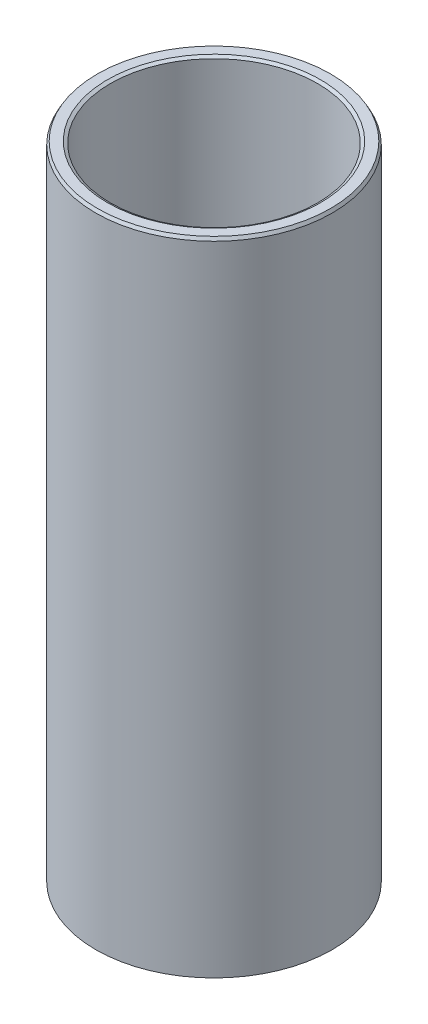
ISO-10303-21;
HEADER;
FILE_DESCRIPTION(('STEP AP214'),'2;1');
FILE_NAME('part.step','',(''),(''),'','','');
FILE_SCHEMA(('AUTOMOTIVE_DESIGN { 1 0 10303 214 1 1 1 1 }'));
ENDSEC;
DATA;
#1=APPLICATION_CONTEXT('core data for automotive mechanical design processes');
#2=APPLICATION_PROTOCOL_DEFINITION('international standard','automotive_design',2000,#1);
#3=PRODUCT_CONTEXT('',#1,'mechanical');
#4=PRODUCT('Part','Part','',(#3));
#5=PRODUCT_RELATED_PRODUCT_CATEGORY('part','',(#4));
#6=PRODUCT_DEFINITION_FORMATION('','',#4);
#7=PRODUCT_DEFINITION_CONTEXT('part definition',#1,'design');
#8=PRODUCT_DEFINITION('design','',#6,#7);
#9=PRODUCT_DEFINITION_SHAPE('','',#8);
#10=(LENGTH_UNIT() NAMED_UNIT(*) SI_UNIT(.MILLI.,.METRE.));
#11=(NAMED_UNIT(*) PLANE_ANGLE_UNIT() SI_UNIT($,.RADIAN.));
#12=(NAMED_UNIT(*) SI_UNIT($,.STERADIAN.) SOLID_ANGLE_UNIT());
#13=UNCERTAINTY_MEASURE_WITH_UNIT(LENGTH_MEASURE(1.E-05),#10,'distance_accuracy_value','');
#14=(GEOMETRIC_REPRESENTATION_CONTEXT(3) GLOBAL_UNCERTAINTY_ASSIGNED_CONTEXT((#13)) GLOBAL_UNIT_ASSIGNED_CONTEXT((#10,
#11,#12)) REPRESENTATION_CONTEXT('',''));
#15=CARTESIAN_POINT('',(0.,0.,0.));
#16=DIRECTION('',(0.,0.,1.));
#17=DIRECTION('',(1.,0.,0.));
#18=AXIS2_PLACEMENT_3D('',#15,#16,#17);
#19=CARTESIAN_POINT('',(0.,230.88460001006,0.));
#20=DIRECTION('',(0.,-1.,0.));
#21=DIRECTION('',(0.,0.,-1.));
#22=AXIS2_PLACEMENT_3D('',#19,#20,#21);
#23=CYLINDRICAL_SURFACE('',#22,42.5);
#24=CARTESIAN_POINT('',(0.,0.627894830380699,0.));
#25=DIRECTION('',(0.,1.,0.));
#26=DIRECTION('',(0.,0.,1.));
#27=AXIS2_PLACEMENT_3D('',#24,#25,#26);
#28=CIRCLE('',#27,42.5);
#29=CARTESIAN_POINT('',(0.,0.627894830380699,-42.5));
#30=VERTEX_POINT('',#29);
#31=EDGE_CURVE('E10',#30,#30,#28,.T.);
#32=CARTESIAN_POINT('',(0.,229.786868164493,0.));
#33=DIRECTION('',(0.,1.,0.));
#34=DIRECTION('',(0.,0.,1.));
#35=AXIS2_PLACEMENT_3D('',#32,#33,#34);
#36=CIRCLE('',#35,42.5);
#37=CARTESIAN_POINT('',(0.,229.786868164493,-42.5));
#38=VERTEX_POINT('',#37);
#39=EDGE_CURVE('E50',#38,#38,#36,.F.);
#40=CARTESIAN_POINT('',(0.,0.627894830380699,-42.5));
#41=CARTESIAN_POINT('',(0.,3.01496746927771,-42.5));
#42=CARTESIAN_POINT('',(0.,5.40204010817472,-42.5));
#43=CARTESIAN_POINT('',(0.,10.1761853859687,-42.5));
#44=CARTESIAN_POINT('',(0.,12.5632580248657,-42.5));
#45=CARTESIAN_POINT('',(0.,17.3374033026597,-42.5));
#46=CARTESIAN_POINT('',(0.,19.7244759415567,-42.5));
#47=CARTESIAN_POINT('',(0.,24.4986212193507,-42.5));
#48=CARTESIAN_POINT('',(0.,26.8856938582477,-42.5));
#49=CARTESIAN_POINT('',(0.,31.6598391360418,-42.5));
#50=CARTESIAN_POINT('',(0.,34.0469117749388,-42.5));
#51=CARTESIAN_POINT('',(0.,38.8210570527328,-42.5));
#52=CARTESIAN_POINT('',(0.,41.2081296916298,-42.5));
#53=CARTESIAN_POINT('',(0.,45.9822749694238,-42.5));
#54=CARTESIAN_POINT('',(0.,48.3693476083208,-42.5));
#55=CARTESIAN_POINT('',(0.,53.1434928861148,-42.5));
#56=CARTESIAN_POINT('',(0.,55.5305655250118,-42.5));
#57=CARTESIAN_POINT('',(0.,60.3047108028058,-42.5));
#58=CARTESIAN_POINT('',(0.,62.6917834417028,-42.5));
#59=CARTESIAN_POINT('',(0.,67.4659287194968,-42.5));
#60=CARTESIAN_POINT('',(0.,69.8530013583939,-42.5));
#61=CARTESIAN_POINT('',(0.,74.6271466361879,-42.5));
#62=CARTESIAN_POINT('',(0.,77.0142192750849,-42.5));
#63=CARTESIAN_POINT('',(0.,81.7883645528789,-42.5));
#64=CARTESIAN_POINT('',(0.,84.1754371917759,-42.5));
#65=CARTESIAN_POINT('',(0.,88.9495824695699,-42.5));
#66=CARTESIAN_POINT('',(0.,91.3366551084669,-42.5));
#67=CARTESIAN_POINT('',(0.,96.1108003862609,-42.5));
#68=CARTESIAN_POINT('',(0.,98.4978730251579,-42.5));
#69=CARTESIAN_POINT('',(0.,103.272018302952,-42.5));
#70=CARTESIAN_POINT('',(0.,105.659090941849,-42.5));
#71=CARTESIAN_POINT('',(0.,110.433236219643,-42.5));
#72=CARTESIAN_POINT('',(0.,112.82030885854,-42.5));
#73=CARTESIAN_POINT('',(0.,117.594454136334,-42.5));
#74=CARTESIAN_POINT('',(0.,119.981526775231,-42.5));
#75=CARTESIAN_POINT('',(0.,124.755672053025,-42.5));
#76=CARTESIAN_POINT('',(0.,127.142744691922,-42.5));
#77=CARTESIAN_POINT('',(0.,131.916889969716,-42.5));
#78=CARTESIAN_POINT('',(0.,134.303962608613,-42.5));
#79=CARTESIAN_POINT('',(0.,139.078107886407,-42.5));
#80=CARTESIAN_POINT('',(0.,141.465180525304,-42.5));
#81=CARTESIAN_POINT('',(0.,146.239325803098,-42.5));
#82=CARTESIAN_POINT('',(0.,148.626398441995,-42.5));
#83=CARTESIAN_POINT('',(0.,153.400543719789,-42.5));
#84=CARTESIAN_POINT('',(0.,155.787616358686,-42.5));
#85=CARTESIAN_POINT('',(0.,160.56176163648,-42.5));
#86=CARTESIAN_POINT('',(0.,162.948834275377,-42.5));
#87=CARTESIAN_POINT('',(0.,167.722979553171,-42.5));
#88=CARTESIAN_POINT('',(0.,170.110052192068,-42.5));
#89=CARTESIAN_POINT('',(0.,174.884197469862,-42.5));
#90=CARTESIAN_POINT('',(0.,177.271270108759,-42.5));
#91=CARTESIAN_POINT('',(0.,182.045415386553,-42.5));
#92=CARTESIAN_POINT('',(0.,184.43248802545,-42.5));
#93=CARTESIAN_POINT('',(0.,189.206633303244,-42.5));
#94=CARTESIAN_POINT('',(0.,191.593705942141,-42.5));
#95=CARTESIAN_POINT('',(0.,196.367851219935,-42.5));
#96=CARTESIAN_POINT('',(0.,198.754923858832,-42.5));
#97=CARTESIAN_POINT('',(0.,203.529069136626,-42.5));
#98=CARTESIAN_POINT('',(0.,205.916141775523,-42.5));
#99=CARTESIAN_POINT('',(0.,210.690287053317,-42.5));
#100=CARTESIAN_POINT('',(0.,213.077359692214,-42.5));
#101=CARTESIAN_POINT('',(0.,217.851504970008,-42.5));
#102=CARTESIAN_POINT('',(0.,220.238577608905,-42.5));
#103=CARTESIAN_POINT('',(0.,225.012722886699,-42.5));
#104=CARTESIAN_POINT('',(0.,227.399795525596,-42.5));
#105=CARTESIAN_POINT('',(0.,229.786868164493,-42.5));
#106=B_SPLINE_CURVE_WITH_KNOTS('',3,(#40,#41,#42,#43,#44,#45,#46,#47,#48,#49,#50,#51,#52,#53,
#54,#55,#56,#57,#58,#59,#60,#61,#62,#63,#64,#65,#66,#67,#68,#69,#70,#71,#72,#73,#74,#75,#76,#77,
#78,#79,#80,#81,#82,#83,#84,#85,#86,#87,#88,#89,#90,#91,#92,#93,#94,#95,#96,#97,#98,#99,#100,
#101,#102,#103,#104,#105),.UNSPECIFIED.,.F.,.F.,(4,2,2,2,2,2,2,2,2,2,2,2,2,2,2,2,2,2,2,2,2,2,2,
2,2,2,2,2,2,2,2,2,4),(0.,7.16121791669103,14.322435833382,21.483653750073,28.6448716667641,
35.8060895834551,42.9673075001461,50.1285254168371,57.2897433335281,64.4509612502192,
71.6121791669102,78.7733970836012,85.9346150002922,93.0958329169832,100.257050833674,
107.418268750365,114.579486667056,121.740704583747,128.901922500438,136.063140417129,
143.22435833382,150.385576250511,157.546794167202,164.708012083893,171.869230000584,
179.030447917275,186.191665833966,193.352883750657,200.514101667348,207.675319584039,
214.83653750073,221.997755417421,229.158973334112),.UNSPECIFIED.);
#107=EDGE_CURVE('BSEAM39',#30,#38,#106,.T.);
#108=ORIENTED_EDGE('',*,*,#31,.T.);
#109=ORIENTED_EDGE('',*,*,#39,.T.);
#110=ORIENTED_EDGE('',*,*,#107,.T.);
#111=ORIENTED_EDGE('',*,*,#107,.F.);
#112=EDGE_LOOP('',(#108,#110,#109,#111));
#113=FACE_BOUND('',#112,.T.);
#114=ADVANCED_FACE('F39',(#113),#23,.T.);
#115=CARTESIAN_POINT('',(0.,230.88460001006,0.));
#116=DIRECTION('',(0.,1.,0.));
#117=DIRECTION('',(0.,0.,1.));
#118=AXIS2_PLACEMENT_3D('',#115,#116,#117);
#119=PLANE('',#118);
#120=CARTESIAN_POINT('',(0.,230.88460001006,0.));
#121=DIRECTION('',(0.,1.,0.));
#122=DIRECTION('',(0.,0.,1.));
#123=AXIS2_PLACEMENT_3D('',#120,#121,#122);
#124=CIRCLE('',#123,38.2811405961849);
#125=CARTESIAN_POINT('',(0.,230.88460001006,38.2811405961849));
#126=VERTEX_POINT('',#125);
#127=EDGE_CURVE('E58',#126,#126,#124,.F.);
#128=ORIENTED_EDGE('',*,*,#127,.T.);
#129=EDGE_LOOP('',(#128));
#130=FACE_BOUND('',#129,.T.);
#131=CARTESIAN_POINT('',(0.,230.88460001006,0.));
#132=DIRECTION('',(0.,1.,0.));
#133=DIRECTION('',(0.,0.,1.));
#134=AXIS2_PLACEMENT_3D('',#131,#132,#133);
#135=CIRCLE('',#134,41.8721051696194);
#136=CARTESIAN_POINT('',(0.,230.88460001006,41.8721051696194));
#137=VERTEX_POINT('',#136);
#138=EDGE_CURVE('E61',#137,#137,#135,.T.);
#139=ORIENTED_EDGE('',*,*,#138,.T.);
#140=EDGE_LOOP('',(#139));
#141=FACE_BOUND('',#140,.T.);
#142=ADVANCED_FACE('F88',(#130,#141),#119,.T.);
#143=CARTESIAN_POINT('',(0.,0.,0.));
#144=DIRECTION('',(0.,1.,0.));
#145=DIRECTION('',(0.,0.,1.));
#146=AXIS2_PLACEMENT_3D('',#143,#144,#145);
#147=PLANE('',#146);
#148=CARTESIAN_POINT('',(0.,0.,0.));
#149=DIRECTION('',(0.,1.,0.));
#150=DIRECTION('',(0.,0.,1.));
#151=AXIS2_PLACEMENT_3D('',#148,#149,#150);
#152=CIRCLE('',#151,37.8113035809982);
#153=CARTESIAN_POINT('',(0.,0.,37.8113035809982));
#154=VERTEX_POINT('',#153);
#155=EDGE_CURVE('E51',#154,#154,#152,.T.);
#156=ORIENTED_EDGE('',*,*,#155,.T.);
#157=EDGE_LOOP('',(#156));
#158=FACE_BOUND('',#157,.T.);
#159=CARTESIAN_POINT('',(0.,0.,0.));
#160=DIRECTION('',(0.,1.,0.));
#161=DIRECTION('',(0.,0.,1.));
#162=AXIS2_PLACEMENT_3D('',#159,#160,#161);
#163=CIRCLE('',#162,41.4022681544326);
#164=CARTESIAN_POINT('',(0.,0.,41.4022681544326));
#165=VERTEX_POINT('',#164);
#166=EDGE_CURVE('E54',#165,#165,#163,.F.);
#167=ORIENTED_EDGE('',*,*,#166,.T.);
#168=EDGE_LOOP('',(#167));
#169=FACE_BOUND('',#168,.T.);
#170=ADVANCED_FACE('F83',(#158,#169),#147,.F.);
#171=CARTESIAN_POINT('',(0.,230.88460001006,0.));
#172=DIRECTION('',(0.,-1.,0.));
#173=DIRECTION('',(0.,0.,-1.));
#174=AXIS2_PLACEMENT_3D('',#171,#172,#173);
#175=CYLINDRICAL_SURFACE('',#174,37.1834087506175);
#176=CARTESIAN_POINT('',(0.,230.25670517968,0.));
#177=DIRECTION('',(0.,1.,0.));
#178=DIRECTION('',(0.,0.,1.));
#179=AXIS2_PLACEMENT_3D('',#176,#177,#178);
#180=CIRCLE('',#179,37.1834087506175);
#181=CARTESIAN_POINT('',(0.,230.25670517968,-37.1834087506175));
#182=VERTEX_POINT('',#181);
#183=EDGE_CURVE('E67',#182,#182,#180,.T.);
#184=CARTESIAN_POINT('',(0.,1.09773184556733,0.));
#185=DIRECTION('',(0.,1.,0.));
#186=DIRECTION('',(0.,0.,1.));
#187=AXIS2_PLACEMENT_3D('',#184,#185,#186);
#188=CIRCLE('',#187,37.1834087506175);
#189=CARTESIAN_POINT('',(0.,1.0977318455673,-37.1834087506175));
#190=VERTEX_POINT('',#189);
#191=EDGE_CURVE('E69',#190,#190,#188,.F.);
#192=CARTESIAN_POINT('',(0.,230.25670517968,-37.1834087506175));
#193=CARTESIAN_POINT('',(0.,227.869632540783,-37.1834087506175));
#194=CARTESIAN_POINT('',(0.,225.482559901886,-37.1834087506175));
#195=CARTESIAN_POINT('',(0.,220.708414624092,-37.1834087506175));
#196=CARTESIAN_POINT('',(0.,218.321341985195,-37.1834087506175));
#197=CARTESIAN_POINT('',(0.,213.547196707401,-37.1834087506175));
#198=CARTESIAN_POINT('',(0.,211.160124068504,-37.1834087506175));
#199=CARTESIAN_POINT('',(0.,206.38597879071,-37.1834087506175));
#200=CARTESIAN_POINT('',(0.,203.998906151813,-37.1834087506175));
#201=CARTESIAN_POINT('',(0.,199.224760874019,-37.1834087506175));
#202=CARTESIAN_POINT('',(0.,196.837688235122,-37.1834087506175));
#203=CARTESIAN_POINT('',(0.,192.063542957327,-37.1834087506175));
#204=CARTESIAN_POINT('',(0.,189.676470318431,-37.1834087506175));
#205=CARTESIAN_POINT('',(0.,184.902325040636,-37.1834087506175));
#206=CARTESIAN_POINT('',(0.,182.51525240174,-37.1834087506175));
#207=CARTESIAN_POINT('',(0.,177.741107123945,-37.1834087506175));
#208=CARTESIAN_POINT('',(0.,175.354034485048,-37.1834087506175));
#209=CARTESIAN_POINT('',(0.,170.579889207254,-37.1834087506175));
#210=CARTESIAN_POINT('',(0.,168.192816568358,-37.1834087506175));
#211=CARTESIAN_POINT('',(0.,163.418671290563,-37.1834087506175));
#212=CARTESIAN_POINT('',(0.,161.031598651666,-37.1834087506175));
#213=CARTESIAN_POINT('',(0.,156.257453373872,-37.1834087506175));
#214=CARTESIAN_POINT('',(0.,153.870380734975,-37.1834087506175));
#215=CARTESIAN_POINT('',(0.,149.096235457181,-37.1834087506175));
#216=CARTESIAN_POINT('',(0.,146.709162818284,-37.1834087506175));
#217=CARTESIAN_POINT('',(0.,141.93501754049,-37.1834087506175));
#218=CARTESIAN_POINT('',(0.,139.547944901593,-37.1834087506175));
#219=CARTESIAN_POINT('',(0.,134.773799623799,-37.1834087506175));
#220=CARTESIAN_POINT('',(0.,132.386726984902,-37.1834087506175));
#221=CARTESIAN_POINT('',(0.,127.612581707108,-37.1834087506175));
#222=CARTESIAN_POINT('',(0.,125.225509068211,-37.1834087506175));
#223=CARTESIAN_POINT('',(0.,120.451363790417,-37.1834087506175));
#224=CARTESIAN_POINT('',(0.,118.06429115152,-37.1834087506175));
#225=CARTESIAN_POINT('',(0.,113.290145873726,-37.1834087506175));
#226=CARTESIAN_POINT('',(0.,110.903073234829,-37.1834087506175));
#227=CARTESIAN_POINT('',(0.,106.128927957035,-37.1834087506175));
#228=CARTESIAN_POINT('',(0.,103.741855318138,-37.1834087506175));
#229=CARTESIAN_POINT('',(0.,98.9677100403444,-37.1834087506175));
#230=CARTESIAN_POINT('',(0.,96.5806374014474,-37.1834087506175));
#231=CARTESIAN_POINT('',(0.,91.8064921236534,-37.1834087506175));
#232=CARTESIAN_POINT('',(0.,89.4194194847564,-37.1834087506175));
#233=CARTESIAN_POINT('',(0.,84.6452742069624,-37.1834087506175));
#234=CARTESIAN_POINT('',(0.,82.2582015680654,-37.1834087506175));
#235=CARTESIAN_POINT('',(0.,77.4840562902714,-37.1834087506175));
#236=CARTESIAN_POINT('',(0.,75.0969836513744,-37.1834087506175));
#237=CARTESIAN_POINT('',(0.,70.3228383735804,-37.1834087506175));
#238=CARTESIAN_POINT('',(0.,67.9357657346834,-37.1834087506175));
#239=CARTESIAN_POINT('',(0.,63.1616204568894,-37.1834087506175));
#240=CARTESIAN_POINT('',(0.,60.7745478179924,-37.1834087506175));
#241=CARTESIAN_POINT('',(0.,56.0004025401984,-37.1834087506175));
#242=CARTESIAN_POINT('',(0.,53.6133299013014,-37.1834087506175));
#243=CARTESIAN_POINT('',(0.,48.8391846235073,-37.1834087506175));
#244=CARTESIAN_POINT('',(0.,46.4521119846103,-37.1834087506175));
#245=CARTESIAN_POINT('',(0.,41.6779667068163,-37.1834087506175));
#246=CARTESIAN_POINT('',(0.,39.2908940679194,-37.1834087506175));
#247=CARTESIAN_POINT('',(0.,34.5167487901253,-37.1834087506175));
#248=CARTESIAN_POINT('',(0.,32.1296761512283,-37.1834087506175));
#249=CARTESIAN_POINT('',(0.,27.3555308734343,-37.1834087506175));
#250=CARTESIAN_POINT('',(0.,24.9684582345373,-37.1834087506175));
#251=CARTESIAN_POINT('',(0.,20.1943129567433,-37.1834087506175));
#252=CARTESIAN_POINT('',(0.,17.8072403178463,-37.1834087506175));
#253=CARTESIAN_POINT('',(0.,13.0330950400523,-37.1834087506175));
#254=CARTESIAN_POINT('',(0.,10.6460224011553,-37.1834087506175));
#255=CARTESIAN_POINT('',(0.,5.8718771233613,-37.1834087506175));
#256=CARTESIAN_POINT('',(0.,3.4848044844643,-37.1834087506175));
#257=CARTESIAN_POINT('',(0.,1.0977318455673,-37.1834087506175));
#258=B_SPLINE_CURVE_WITH_KNOTS('',3,(#192,#193,#194,#195,#196,#197,#198,#199,#200,#201,#202,
#203,#204,#205,#206,#207,#208,#209,#210,#211,#212,#213,#214,#215,#216,#217,#218,#219,#220,#221,
#222,#223,#224,#225,#226,#227,#228,#229,#230,#231,#232,#233,#234,#235,#236,#237,#238,#239,#240,
#241,#242,#243,#244,#245,#246,#247,#248,#249,#250,#251,#252,#253,#254,#255,#256,#257),
.UNSPECIFIED.,.F.,.F.,(4,2,2,2,2,2,2,2,2,2,2,2,2,2,2,2,2,2,2,2,2,2,2,2,2,2,2,2,2,2,2,2,4),(0.,
7.161217916691,14.322435833382,21.483653750073,28.644871666764,35.806089583455,42.967307500146,
50.128525416837,57.289743333528,64.450961250219,71.6121791669101,78.7733970836011,
85.9346150002921,93.0958329169831,100.257050833674,107.418268750365,114.579486667056,
121.740704583747,128.901922500438,136.063140417129,143.22435833382,150.385576250511,
157.546794167202,164.708012083893,171.869230000584,179.030447917275,186.191665833966,
193.352883750657,200.514101667348,207.675319584039,214.83653750073,221.997755417421,
229.158973334112),.UNSPECIFIED.);
#259=EDGE_CURVE('BSEAM71',#182,#190,#258,.T.);
#260=ORIENTED_EDGE('',*,*,#183,.T.);
#261=ORIENTED_EDGE('',*,*,#191,.T.);
#262=ORIENTED_EDGE('',*,*,#259,.T.);
#263=ORIENTED_EDGE('',*,*,#259,.F.);
#264=EDGE_LOOP('',(#260,#262,#261,#263));
#265=FACE_BOUND('',#264,.T.);
#266=ADVANCED_FACE('F71',(#265),#175,.F.);
#267=CARTESIAN_POINT('',(0.,230.25670517968,0.));
#268=DIRECTION('',(0.,1.,0.));
#269=DIRECTION('',(0.,0.,1.));
#270=AXIS2_PLACEMENT_3D('',#267,#268,#269);
#271=CONICAL_SURFACE('',#270,37.1834087506175,1.05122489313124);
#272=ORIENTED_EDGE('',*,*,#127,.F.);
#273=EDGE_LOOP('',(#272));
#274=FACE_BOUND('',#273,.T.);
#275=ORIENTED_EDGE('',*,*,#183,.F.);
#276=EDGE_LOOP('',(#275));
#277=FACE_BOUND('',#276,.T.);
#278=ADVANCED_FACE('F77',(#274,#277),#271,.F.);
#279=CARTESIAN_POINT('',(0.,0.,0.));
#280=DIRECTION('',(0.,-1.,0.));
#281=DIRECTION('',(0.,0.,-1.));
#282=AXIS2_PLACEMENT_3D('',#279,#280,#281);
#283=CONICAL_SURFACE('',#282,37.8113035809982,0.519571433663627);
#284=ORIENTED_EDGE('',*,*,#191,.F.);
#285=EDGE_LOOP('',(#284));
#286=FACE_BOUND('',#285,.T.);
#287=ORIENTED_EDGE('',*,*,#155,.F.);
#288=EDGE_LOOP('',(#287));
#289=FACE_BOUND('',#288,.T.);
#290=ADVANCED_FACE('F73',(#286,#289),#283,.F.);
#291=CARTESIAN_POINT('',(0.,0.627894830380699,0.));
#292=DIRECTION('',(0.,1.,0.));
#293=DIRECTION('',(0.,0.,1.));
#294=AXIS2_PLACEMENT_3D('',#291,#292,#293);
#295=CONICAL_SURFACE('',#294,42.5,1.05122489313127);
#296=ORIENTED_EDGE('',*,*,#166,.F.);
#297=EDGE_LOOP('',(#296));
#298=FACE_BOUND('',#297,.T.);
#299=ORIENTED_EDGE('',*,*,#31,.F.);
#300=EDGE_LOOP('',(#299));
#301=FACE_BOUND('',#300,.T.);
#302=ADVANCED_FACE('F76',(#298,#301),#295,.T.);
#303=CARTESIAN_POINT('',(0.,230.88460001006,0.));
#304=DIRECTION('',(0.,-1.,0.));
#305=DIRECTION('',(0.,0.,-1.));
#306=AXIS2_PLACEMENT_3D('',#303,#304,#305);
#307=CONICAL_SURFACE('',#306,41.8721051696194,0.519571433663654);
#308=ORIENTED_EDGE('',*,*,#39,.F.);
#309=EDGE_LOOP('',(#308));
#310=FACE_BOUND('',#309,.T.);
#311=ORIENTED_EDGE('',*,*,#138,.F.);
#312=EDGE_LOOP('',(#311));
#313=FACE_BOUND('',#312,.T.);
#314=ADVANCED_FACE('F45',(#310,#313),#307,.T.);
#315=CLOSED_SHELL('',(#114,#142,#170,#266,#278,#290,#302,#314));
#316=MANIFOLD_SOLID_BREP('B2',#315);
#317=ADVANCED_BREP_SHAPE_REPRESENTATION('',(#18,#316),#14);
#318=SHAPE_DEFINITION_REPRESENTATION(#9,#317);
ENDSEC;
END-ISO-10303-21;
